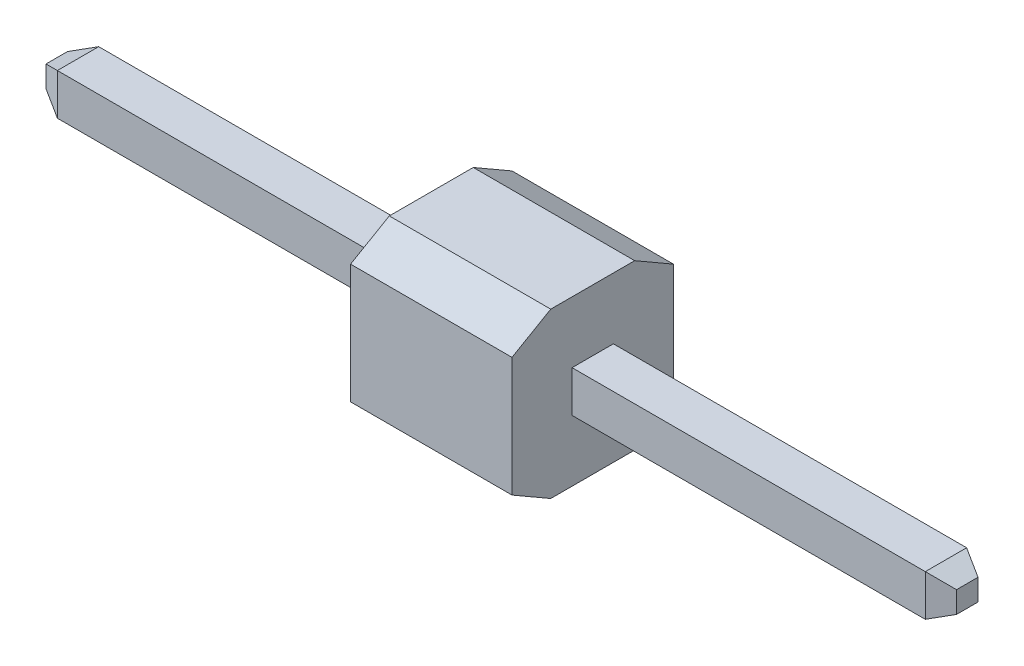
ISO-10303-21;
HEADER;
FILE_DESCRIPTION(('STEP AP214'),'2;1');
FILE_NAME('part.step','',(''),(''),'','','');
FILE_SCHEMA(('AUTOMOTIVE_DESIGN { 1 0 10303 214 1 1 1 1 }'));
ENDSEC;
DATA;
#1=APPLICATION_CONTEXT('core data for automotive mechanical design processes');
#2=APPLICATION_PROTOCOL_DEFINITION('international standard','automotive_design',2000,#1);
#3=PRODUCT_CONTEXT('',#1,'mechanical');
#4=PRODUCT('Part','Part','',(#3));
#5=PRODUCT_RELATED_PRODUCT_CATEGORY('part','',(#4));
#6=PRODUCT_DEFINITION_FORMATION('','',#4);
#7=PRODUCT_DEFINITION_CONTEXT('part definition',#1,'design');
#8=PRODUCT_DEFINITION('design','',#6,#7);
#9=PRODUCT_DEFINITION_SHAPE('','',#8);
#10=(LENGTH_UNIT() NAMED_UNIT(*) SI_UNIT(.MILLI.,.METRE.));
#11=(NAMED_UNIT(*) PLANE_ANGLE_UNIT() SI_UNIT($,.RADIAN.));
#12=(NAMED_UNIT(*) SI_UNIT($,.STERADIAN.) SOLID_ANGLE_UNIT());
#13=UNCERTAINTY_MEASURE_WITH_UNIT(LENGTH_MEASURE(1.E-05),#10,'distance_accuracy_value','');
#14=(GEOMETRIC_REPRESENTATION_CONTEXT(3) GLOBAL_UNCERTAINTY_ASSIGNED_CONTEXT((#13)) GLOBAL_UNIT_ASSIGNED_CONTEXT((#10,
#11,#12)) REPRESENTATION_CONTEXT('',''));
#15=CARTESIAN_POINT('',(0.,0.,0.));
#16=DIRECTION('',(0.,0.,1.));
#17=DIRECTION('',(1.,0.,0.));
#18=AXIS2_PLACEMENT_3D('',#15,#16,#17);
#19=CARTESIAN_POINT('',(5.42107494554601,-0.317121587193697,0.629998634255617));
#20=DIRECTION('',(1.,4.37113882867379E-08,-4.37113882867379E-08));
#21=DIRECTION('',(-4.37113882867379E-08,1.,0.));
#22=AXIS2_PLACEMENT_3D('',#19,#20,#21);
#23=PLANE('',#22);
#24=DIRECTION('',(1.59994777304463E-08,0.500000000000192,0.866025403784328));
#25=VECTOR('',#24,1.);
#26=CARTESIAN_POINT('',(5.42107482256009,0.926468251296299,-0.940001365744382));
#27=LINE('',#26,#25);
#28=CARTESIAN_POINT('',(5.42107482256009,0.926468251296299,-0.940001365744382));
#29=VERTEX_POINT('',#28);
#30=CARTESIAN_POINT('',(5.42107483364485,1.2728784128063,-0.340001365744383));
#31=VERTEX_POINT('',#30);
#32=EDGE_CURVE('E11',#29,#31,#27,.T.);
#33=ORIENTED_EDGE('',*,*,#32,.T.);
#34=DIRECTION('',(4.37113886966664E-08,0.,0.999999999999999));
#35=VECTOR('',#34,1.);
#36=CARTESIAN_POINT('',(5.42107483364485,1.2728784128063,-0.340001365744383));
#37=LINE('',#36,#35);
#38=CARTESIAN_POINT('',(5.42107489046966,1.2728784128063,0.959998634255618));
#39=VERTEX_POINT('',#38);
#40=EDGE_CURVE('E304',#31,#39,#37,.T.);
#41=ORIENTED_EDGE('',*,*,#40,.T.);
#42=DIRECTION('',(5.9710866882576E-08,-0.500000000000187,0.866025403784329));
#43=VECTOR('',#42,1.);
#44=CARTESIAN_POINT('',(5.42107489046966,1.2728784128063,0.959998634255618));
#45=LINE('',#44,#43);
#46=CARTESIAN_POINT('',(5.42107493183856,0.926468251296305,1.55999863425562));
#47=VERTEX_POINT('',#46);
#48=EDGE_CURVE('E296',#39,#47,#45,.T.);
#49=ORIENTED_EDGE('',*,*,#48,.T.);
#50=DIRECTION('',(4.37113884815545E-08,-0.999999999999999,0.));
#51=VECTOR('',#50,1.);
#52=CARTESIAN_POINT('',(5.42107493183856,0.926468251296305,1.55999863425562));
#53=LINE('',#52,#51);
#54=CARTESIAN_POINT('',(5.42107501258135,-0.920711425673696,1.55999863425562));
#55=VERTEX_POINT('',#54);
#56=EDGE_CURVE('E281',#47,#55,#53,.T.);
#57=ORIENTED_EDGE('',*,*,#56,.T.);
#58=DIRECTION('',(1.5999479012306E-08,0.500000000000192,0.866025403784328));
#59=VECTOR('',#58,1.);
#60=CARTESIAN_POINT('',(5.42107500149658,-1.2671215871937,0.959998634255618));
#61=LINE('',#60,#59);
#62=CARTESIAN_POINT('',(5.42107500149658,-1.2671215871937,0.959998634255618));
#63=VERTEX_POINT('',#62);
#64=EDGE_CURVE('E265',#63,#55,#61,.T.);
#65=ORIENTED_EDGE('',*,*,#64,.F.);
#66=DIRECTION('',(4.37113886966664E-08,0.,0.999999999999999));
#67=VECTOR('',#66,1.);
#68=CARTESIAN_POINT('',(5.42107494467178,-1.2671215871937,-0.340001365744383));
#69=LINE('',#68,#67);
#70=CARTESIAN_POINT('',(5.42107494467178,-1.2671215871937,-0.340001365744383));
#71=VERTEX_POINT('',#70);
#72=EDGE_CURVE('E248',#71,#63,#69,.T.);
#73=ORIENTED_EDGE('',*,*,#72,.F.);
#74=DIRECTION('',(5.97108656001699E-08,-0.500000000000189,0.866025403784328));
#75=VECTOR('',#74,1.);
#76=CARTESIAN_POINT('',(5.42107490330288,-0.920711425673701,-0.940001365744382));
#77=LINE('',#76,#75);
#78=CARTESIAN_POINT('',(5.42107490330288,-0.920711425673701,-0.940001365744382));
#79=VERTEX_POINT('',#78);
#80=EDGE_CURVE('E242',#79,#71,#77,.T.);
#81=ORIENTED_EDGE('',*,*,#80,.F.);
#82=DIRECTION('',(4.37113884815545E-08,-0.999999999999999,0.));
#83=VECTOR('',#82,1.);
#84=CARTESIAN_POINT('',(5.42107482256009,0.926468251296299,-0.940001365744382));
#85=LINE('',#84,#83);
#86=EDGE_CURVE('E236',#29,#79,#85,.T.);
#87=ORIENTED_EDGE('',*,*,#86,.F.);
#88=EDGE_LOOP('',(#33,#41,#49,#57,#65,#73,#81,#87));
#89=FACE_BOUND('',#88,.T.);
#90=DIRECTION('',(-4.37113886753159E-08,0.,-0.999999999999999));
#91=VECTOR('',#90,1.);
#92=CARTESIAN_POINT('',(5.42107491757072,0.322878412806302,0.629998634255617));
#93=LINE('',#92,#91);
#94=CARTESIAN_POINT('',(5.42107491757072,0.322878412806302,0.629998634255617));
#95=VERTEX_POINT('',#94);
#96=CARTESIAN_POINT('',(5.42107488959543,0.322878412806301,-0.0100013657443826));
#97=VERTEX_POINT('',#96);
#98=EDGE_CURVE('E302',#95,#97,#93,.T.);
#99=ORIENTED_EDGE('',*,*,#98,.T.);
#100=DIRECTION('',(-4.3711388675316E-08,0.999999999999999,0.));
#101=VECTOR('',#100,1.);
#102=CARTESIAN_POINT('',(5.42107491757072,-0.317121587193698,-0.0100013657443826));
#103=LINE('',#102,#101);
#104=CARTESIAN_POINT('',(5.42107491757072,-0.317121587193698,-0.0100013657443826));
#105=VERTEX_POINT('',#104);
#106=EDGE_CURVE('E293',#105,#97,#103,.T.);
#107=ORIENTED_EDGE('',*,*,#106,.F.);
#108=DIRECTION('',(-4.37113886753159E-08,0.,-0.999999999999999));
#109=VECTOR('',#108,1.);
#110=CARTESIAN_POINT('',(5.42107494554601,-0.317121587193697,0.629998634255617));
#111=LINE('',#110,#109);
#112=CARTESIAN_POINT('',(5.42107494554601,-0.317121587193697,0.629998634255617));
#113=VERTEX_POINT('',#112);
#114=EDGE_CURVE('E278',#113,#105,#111,.T.);
#115=ORIENTED_EDGE('',*,*,#114,.F.);
#116=DIRECTION('',(-4.3711388675316E-08,0.999999999999999,0.));
#117=VECTOR('',#116,1.);
#118=CARTESIAN_POINT('',(5.42107494554601,-0.317121587193697,0.629998634255617));
#119=LINE('',#118,#117);
#120=EDGE_CURVE('E263',#113,#95,#119,.T.);
#121=ORIENTED_EDGE('',*,*,#120,.T.);
#122=EDGE_LOOP('',(#99,#107,#115,#121));
#123=FACE_BOUND('',#122,.T.);
#124=ADVANCED_FACE('F17',(#89,#123),#23,.T.);
#125=CARTESIAN_POINT('',(2.92107494554601,-0.317121696472167,0.629998743534088));
#126=DIRECTION('',(1.,4.37113882867379E-08,-4.37113882867379E-08));
#127=DIRECTION('',(-4.37113882867379E-08,1.,0.));
#128=AXIS2_PLACEMENT_3D('',#125,#126,#127);
#129=PLANE('',#128);
#130=DIRECTION('',(1.59994783714339E-08,0.500000000000192,0.866025403784328));
#131=VECTOR('',#130,1.);
#132=CARTESIAN_POINT('',(2.92107482256009,0.926468142017828,-0.940001256465912));
#133=LINE('',#132,#131);
#134=CARTESIAN_POINT('',(2.92107482256009,0.926468142017828,-0.940001256465912));
#135=VERTEX_POINT('',#134);
#136=CARTESIAN_POINT('',(2.92107483364485,1.27287830352783,-0.340001256465912));
#137=VERTEX_POINT('',#136);
#138=EDGE_CURVE('E24',#135,#137,#133,.T.);
#139=ORIENTED_EDGE('',*,*,#138,.F.);
#140=DIRECTION('',(4.37113882411397E-08,-0.999999999999999,0.));
#141=VECTOR('',#140,1.);
#142=CARTESIAN_POINT('',(2.92107482256009,0.926468142017828,-0.940001256465912));
#143=LINE('',#142,#141);
#144=CARTESIAN_POINT('',(2.92107490330288,-0.920711534952172,-0.940001256465912));
#145=VERTEX_POINT('',#144);
#146=EDGE_CURVE('E300',#135,#145,#143,.T.);
#147=ORIENTED_EDGE('',*,*,#146,.T.);
#148=DIRECTION('',(5.97108668821451E-08,-0.500000000000189,0.866025403784328));
#149=VECTOR('',#148,1.);
#150=CARTESIAN_POINT('',(2.92107490330288,-0.920711534952172,-0.940001256465912));
#151=LINE('',#150,#149);
#152=CARTESIAN_POINT('',(2.92107494467178,-1.26712169647217,-0.340001256465912));
#153=VERTEX_POINT('',#152);
#154=EDGE_CURVE('E286',#145,#153,#151,.T.);
#155=ORIENTED_EDGE('',*,*,#154,.T.);
#156=DIRECTION('',(4.37113883550593E-08,0.,0.999999999999999));
#157=VECTOR('',#156,1.);
#158=CARTESIAN_POINT('',(2.92107494467178,-1.26712169647217,-0.340001256465912));
#159=LINE('',#158,#157);
#160=CARTESIAN_POINT('',(2.92107500149659,-1.26712169647217,0.959998743534088));
#161=VERTEX_POINT('',#160);
#162=EDGE_CURVE('E271',#153,#161,#159,.T.);
#163=ORIENTED_EDGE('',*,*,#162,.T.);
#164=DIRECTION('',(1.59994783713184E-08,0.500000000000192,0.866025403784328));
#165=VECTOR('',#164,1.);
#166=CARTESIAN_POINT('',(2.92107500149659,-1.26712169647217,0.959998743534088));
#167=LINE('',#166,#165);
#168=CARTESIAN_POINT('',(2.92107501258135,-0.920711534952167,1.55999874353409));
#169=VERTEX_POINT('',#168);
#170=EDGE_CURVE('E253',#161,#169,#167,.T.);
#171=ORIENTED_EDGE('',*,*,#170,.T.);
#172=DIRECTION('',(4.37113882411397E-08,-0.999999999999999,0.));
#173=VECTOR('',#172,1.);
#174=CARTESIAN_POINT('',(2.92107493183856,0.926468142017834,1.55999874353409));
#175=LINE('',#174,#173);
#176=CARTESIAN_POINT('',(2.92107493183856,0.926468142017834,1.55999874353409));
#177=VERTEX_POINT('',#176);
#178=EDGE_CURVE('E261',#177,#169,#175,.T.);
#179=ORIENTED_EDGE('',*,*,#178,.F.);
#180=DIRECTION('',(5.9710866882576E-08,-0.500000000000187,0.866025403784329));
#181=VECTOR('',#180,1.);
#182=CARTESIAN_POINT('',(2.92107489046966,1.27287830352783,0.959998743534088));
#183=LINE('',#182,#181);
#184=CARTESIAN_POINT('',(2.92107489046966,1.27287830352783,0.959998743534088));
#185=VERTEX_POINT('',#184);
#186=EDGE_CURVE('E276',#185,#177,#183,.T.);
#187=ORIENTED_EDGE('',*,*,#186,.F.);
#188=DIRECTION('',(4.37113883550593E-08,0.,0.999999999999999));
#189=VECTOR('',#188,1.);
#190=CARTESIAN_POINT('',(2.92107483364485,1.27287830352783,-0.340001256465912));
#191=LINE('',#190,#189);
#192=EDGE_CURVE('E291',#137,#185,#191,.T.);
#193=ORIENTED_EDGE('',*,*,#192,.F.);
#194=EDGE_LOOP('',(#139,#147,#155,#163,#171,#179,#187,#193));
#195=FACE_BOUND('',#194,.T.);
#196=DIRECTION('',(-4.3711388675316E-08,0.999999999999999,0.));
#197=VECTOR('',#196,1.);
#198=CARTESIAN_POINT('',(2.92107491757072,-0.317121696472169,-0.0100012564659119));
#199=LINE('',#198,#197);
#200=CARTESIAN_POINT('',(2.92107491757072,-0.317121696472169,-0.0100012564659119));
#201=VERTEX_POINT('',#200);
#202=CARTESIAN_POINT('',(2.92107488959543,0.32287830352783,-0.0100012564659119));
#203=VERTEX_POINT('',#202);
#204=EDGE_CURVE('E298',#201,#203,#199,.T.);
#205=ORIENTED_EDGE('',*,*,#204,.T.);
#206=DIRECTION('',(-4.37113886753159E-08,0.,-0.999999999999999));
#207=VECTOR('',#206,1.);
#208=CARTESIAN_POINT('',(2.92107491757072,0.322878303527832,0.629998743534088));
#209=LINE('',#208,#207);
#210=CARTESIAN_POINT('',(2.92107491757072,0.322878303527832,0.629998743534088));
#211=VERTEX_POINT('',#210);
#212=EDGE_CURVE('E283',#211,#203,#209,.T.);
#213=ORIENTED_EDGE('',*,*,#212,.F.);
#214=DIRECTION('',(-4.37113879814266E-08,0.999999999999999,0.));
#215=VECTOR('',#214,1.);
#216=CARTESIAN_POINT('',(2.92107494554601,-0.317121696472167,0.629998743534088));
#217=LINE('',#216,#215);
#218=CARTESIAN_POINT('',(2.92107494554601,-0.317121696472167,0.629998743534088));
#219=VERTEX_POINT('',#218);
#220=EDGE_CURVE('E268',#219,#211,#217,.T.);
#221=ORIENTED_EDGE('',*,*,#220,.F.);
#222=DIRECTION('',(-4.37113879814266E-08,0.,-0.999999999999999));
#223=VECTOR('',#222,1.);
#224=CARTESIAN_POINT('',(2.92107494554601,-0.317121696472167,0.629998743534088));
#225=LINE('',#224,#223);
#226=EDGE_CURVE('E251',#219,#201,#225,.T.);
#227=ORIENTED_EDGE('',*,*,#226,.T.);
#228=EDGE_LOOP('',(#205,#213,#221,#227));
#229=FACE_BOUND('',#228,.T.);
#230=ADVANCED_FACE('F314',(#195,#229),#129,.F.);
#231=CARTESIAN_POINT('',(5.42107482256009,0.926468251296299,-0.940001365744382));
#232=DIRECTION('',(5.97108668343731E-08,-0.866025403784328,0.50000000000019));
#233=DIRECTION('',(-1.59994785476185E-08,-0.500000000000192,-0.866025403784329));
#234=AXIS2_PLACEMENT_3D('',#231,#232,#233);
#235=PLANE('',#234);
#236=ORIENTED_EDGE('',*,*,#138,.T.);
#237=DIRECTION('',(-0.999999999999998,-4.37113882867378E-08,4.37113883755557E-08));
#238=VECTOR('',#237,1.);
#239=CARTESIAN_POINT('',(5.42107483364485,1.2728784128063,-0.340001365744383));
#240=LINE('',#239,#238);
#241=EDGE_CURVE('E288',#31,#137,#240,.T.);
#242=ORIENTED_EDGE('',*,*,#241,.F.);
#243=ORIENTED_EDGE('',*,*,#32,.F.);
#244=DIRECTION('',(-0.999999999999998,-4.37113882867378E-08,4.37113881091022E-08));
#245=VECTOR('',#244,1.);
#246=CARTESIAN_POINT('',(5.42107482256009,0.926468251296299,-0.940001365744382));
#247=LINE('',#246,#245);
#248=EDGE_CURVE('E256',#29,#135,#247,.T.);
#249=ORIENTED_EDGE('',*,*,#248,.T.);
#250=EDGE_LOOP('',(#236,#242,#243,#249));
#251=FACE_BOUND('',#250,.T.);
#252=ADVANCED_FACE('F306',(#251),#235,.F.);
#253=CARTESIAN_POINT('',(5.42107483364485,1.2728784128063,-0.340001365744383));
#254=DIRECTION('',(4.37113882867379E-08,-1.,0.));
#255=DIRECTION('',(1.,4.37113882867379E-08,-4.37113882867379E-08));
#256=AXIS2_PLACEMENT_3D('',#253,#254,#255);
#257=PLANE('',#256);
#258=ORIENTED_EDGE('',*,*,#192,.T.);
#259=DIRECTION('',(-0.999999999999998,-4.37113882867378E-08,4.37113882867378E-08));
#260=VECTOR('',#259,1.);
#261=CARTESIAN_POINT('',(5.42107489046966,1.2728784128063,0.959998634255618));
#262=LINE('',#261,#260);
#263=EDGE_CURVE('E273',#39,#185,#262,.T.);
#264=ORIENTED_EDGE('',*,*,#263,.F.);
#265=ORIENTED_EDGE('',*,*,#40,.F.);
#266=ORIENTED_EDGE('',*,*,#241,.T.);
#267=EDGE_LOOP('',(#258,#264,#265,#266));
#268=FACE_BOUND('',#267,.T.);
#269=ADVANCED_FACE('F311',(#268),#257,.F.);
#270=CARTESIAN_POINT('',(5.42107489046966,1.2728784128063,0.959998634255618));
#271=DIRECTION('',(1.59994785476185E-08,-0.86602540378433,-0.50000000000019));
#272=DIRECTION('',(-5.97108668343731E-08,0.500000000000188,-0.866025403784329));
#273=AXIS2_PLACEMENT_3D('',#270,#271,#272);
#274=PLANE('',#273);
#275=ORIENTED_EDGE('',*,*,#186,.T.);
#276=DIRECTION('',(-0.999999999999998,-4.37113882867378E-08,4.37113882867378E-08));
#277=VECTOR('',#276,1.);
#278=CARTESIAN_POINT('',(5.42107493183856,0.926468251296305,1.55999863425562));
#279=LINE('',#278,#277);
#280=EDGE_CURVE('E258',#47,#177,#279,.T.);
#281=ORIENTED_EDGE('',*,*,#280,.F.);
#282=ORIENTED_EDGE('',*,*,#48,.F.);
#283=ORIENTED_EDGE('',*,*,#263,.T.);
#284=EDGE_LOOP('',(#275,#281,#282,#283));
#285=FACE_BOUND('',#284,.T.);
#286=ADVANCED_FACE('F319',(#285),#274,.F.);
#287=CARTESIAN_POINT('',(5.42107493183856,0.926468251296305,1.55999863425562));
#288=DIRECTION('',(-4.37113882867379E-08,0.,-1.));
#289=DIRECTION('',(-1.,-4.37113882867379E-08,4.37113882867379E-08));
#290=AXIS2_PLACEMENT_3D('',#287,#288,#289);
#291=PLANE('',#290);
#292=ORIENTED_EDGE('',*,*,#178,.T.);
#293=DIRECTION('',(-0.999999999999998,-4.37113897078233E-08,4.37113882867378E-08));
#294=VECTOR('',#293,1.);
#295=CARTESIAN_POINT('',(5.42107501258135,-0.920711425673696,1.55999863425562));
#296=LINE('',#295,#294);
#297=EDGE_CURVE('E245',#55,#169,#296,.T.);
#298=ORIENTED_EDGE('',*,*,#297,.F.);
#299=ORIENTED_EDGE('',*,*,#56,.F.);
#300=ORIENTED_EDGE('',*,*,#280,.T.);
#301=EDGE_LOOP('',(#292,#298,#299,#300));
#302=FACE_BOUND('',#301,.T.);
#303=ADVANCED_FACE('F326',(#302),#291,.F.);
#304=CARTESIAN_POINT('',(5.42107500149658,-1.2671215871937,0.959998634255618));
#305=DIRECTION('',(5.97108668343731E-08,-0.866025403784328,0.50000000000019));
#306=DIRECTION('',(-1.59994785476185E-08,-0.500000000000192,-0.866025403784329));
#307=AXIS2_PLACEMENT_3D('',#304,#305,#306);
#308=PLANE('',#307);
#309=ORIENTED_EDGE('',*,*,#170,.F.);
#310=DIRECTION('',(-0.999999999999998,-4.37113875761951E-08,4.37113882867378E-08));
#311=VECTOR('',#310,1.);
#312=CARTESIAN_POINT('',(5.42107500149658,-1.2671215871937,0.959998634255618));
#313=LINE('',#312,#311);
#314=EDGE_CURVE('E239',#63,#161,#313,.T.);
#315=ORIENTED_EDGE('',*,*,#314,.F.);
#316=ORIENTED_EDGE('',*,*,#64,.T.);
#317=ORIENTED_EDGE('',*,*,#297,.T.);
#318=EDGE_LOOP('',(#309,#315,#316,#317));
#319=FACE_BOUND('',#318,.T.);
#320=ADVANCED_FACE('F329',(#319),#308,.T.);
#321=CARTESIAN_POINT('',(5.42107494467178,-1.2671215871937,-0.340001365744383));
#322=DIRECTION('',(4.37113882867379E-08,-1.,0.));
#323=DIRECTION('',(1.,4.37113882867379E-08,-4.37113882867379E-08));
#324=AXIS2_PLACEMENT_3D('',#321,#322,#323);
#325=PLANE('',#324);
#326=ORIENTED_EDGE('',*,*,#162,.F.);
#327=DIRECTION('',(-0.999999999999998,-4.37113875761951E-08,4.37113883755557E-08));
#328=VECTOR('',#327,1.);
#329=CARTESIAN_POINT('',(5.42107494467178,-1.2671215871937,-0.340001365744383));
#330=LINE('',#329,#328);
#331=EDGE_CURVE('E233',#71,#153,#330,.T.);
#332=ORIENTED_EDGE('',*,*,#331,.F.);
#333=ORIENTED_EDGE('',*,*,#72,.T.);
#334=ORIENTED_EDGE('',*,*,#314,.T.);
#335=EDGE_LOOP('',(#326,#332,#333,#334));
#336=FACE_BOUND('',#335,.T.);
#337=ADVANCED_FACE('F333',(#336),#325,.T.);
#338=CARTESIAN_POINT('',(5.42107490330288,-0.920711425673701,-0.940001365744382));
#339=DIRECTION('',(1.59994785476185E-08,-0.86602540378433,-0.50000000000019));
#340=DIRECTION('',(-5.97108668343731E-08,0.500000000000188,-0.866025403784329));
#341=AXIS2_PLACEMENT_3D('',#338,#339,#340);
#342=PLANE('',#341);
#343=ORIENTED_EDGE('',*,*,#154,.F.);
#344=DIRECTION('',(-0.999999999999998,-4.37113897078233E-08,4.37113881091021E-08));
#345=VECTOR('',#344,1.);
#346=CARTESIAN_POINT('',(5.42107490330288,-0.920711425673701,-0.940001365744382));
#347=LINE('',#346,#345);
#348=EDGE_CURVE('E230',#79,#145,#347,.T.);
#349=ORIENTED_EDGE('',*,*,#348,.F.);
#350=ORIENTED_EDGE('',*,*,#80,.T.);
#351=ORIENTED_EDGE('',*,*,#331,.T.);
#352=EDGE_LOOP('',(#343,#349,#350,#351));
#353=FACE_BOUND('',#352,.T.);
#354=ADVANCED_FACE('F337',(#353),#342,.T.);
#355=CARTESIAN_POINT('',(5.42107482256009,0.926468251296299,-0.940001365744382));
#356=DIRECTION('',(-4.37113882867379E-08,0.,-1.));
#357=DIRECTION('',(-4.37113882867379E-08,1.,0.));
#358=AXIS2_PLACEMENT_3D('',#355,#356,#357);
#359=PLANE('',#358);
#360=ORIENTED_EDGE('',*,*,#146,.F.);
#361=ORIENTED_EDGE('',*,*,#248,.F.);
#362=ORIENTED_EDGE('',*,*,#86,.T.);
#363=ORIENTED_EDGE('',*,*,#348,.T.);
#364=EDGE_LOOP('',(#360,#361,#362,#363));
#365=FACE_BOUND('',#364,.T.);
#366=ADVANCED_FACE('F339',(#365),#359,.T.);
#367=CARTESIAN_POINT('',(-2.87892505445399,-0.317121949998219,0.62999899706014));
#368=DIRECTION('',(-1.,-4.37113882867379E-08,4.37113882867379E-08));
#369=DIRECTION('',(4.37113882867379E-08,-1.,0.));
#370=AXIS2_PLACEMENT_3D('',#367,#368,#369);
#371=PLANE('',#370);
#372=DIRECTION('',(4.37113900757526E-08,-0.999999999999999,0.));
#373=VECTOR('',#372,1.);
#374=CARTESIAN_POINT('',(-2.87892509695182,0.168996522811778,0.14388052425114));
#375=LINE('',#374,#373);
#376=CARTESIAN_POINT('',(-2.87892509695182,0.168996522811778,0.14388052425114));
#377=VERTEX_POINT('',#376);
#378=CARTESIAN_POINT('',(-2.87892508242928,-0.163240422798221,0.14388052425114));
#379=VERTEX_POINT('',#378);
#380=EDGE_CURVE('E228',#377,#379,#375,.T.);
#381=ORIENTED_EDGE('',*,*,#380,.T.);
#382=DIRECTION('',(4.37113874013716E-08,0.,0.999999999999999));
#383=VECTOR('',#382,1.);
#384=CARTESIAN_POINT('',(-2.87892508242928,-0.163240422798221,0.14388052425114));
#385=LINE('',#384,#383);
#386=CARTESIAN_POINT('',(-2.87892506790674,-0.16324042279822,0.47611746986914));
#387=VERTEX_POINT('',#386);
#388=EDGE_CURVE('E223',#379,#387,#385,.T.);
#389=ORIENTED_EDGE('',*,*,#388,.T.);
#390=DIRECTION('',(-4.37113847290958E-08,0.999999999999999,0.));
#391=VECTOR('',#390,1.);
#392=CARTESIAN_POINT('',(-2.87892506790674,-0.163240422798221,0.47611746986914));
#393=LINE('',#392,#391);
#394=CARTESIAN_POINT('',(-2.87892508242928,0.16899652281178,0.47611746986914));
#395=VERTEX_POINT('',#394);
#396=EDGE_CURVE('E215',#387,#395,#393,.T.);
#397=ORIENTED_EDGE('',*,*,#396,.T.);
#398=DIRECTION('',(-4.37113820547151E-08,0.,-0.999999999999999));
#399=VECTOR('',#398,1.);
#400=CARTESIAN_POINT('',(-2.87892508242928,0.16899652281178,0.47611746986914));
#401=LINE('',#400,#399);
#402=EDGE_CURVE('E207',#395,#377,#401,.T.);
#403=ORIENTED_EDGE('',*,*,#402,.T.);
#404=EDGE_LOOP('',(#381,#389,#397,#403));
#405=FACE_BOUND('',#404,.T.);
#406=ADVANCED_FACE('F341',(#405),#371,.T.);
#407=CARTESIAN_POINT('',(-2.87892505445399,-0.317121949998219,0.62999899706014));
#408=DIRECTION('',(4.37113882867379E-08,-1.,0.));
#409=DIRECTION('',(-4.37113882867379E-08,0.,-1.));
#410=AXIS2_PLACEMENT_3D('',#407,#408,#409);
#411=PLANE('',#410);
#412=DIRECTION('',(0.999999999999998,4.37113875463186E-08,-4.37113882769955E-08));
#413=VECTOR('',#412,1.);
#414=CARTESIAN_POINT('',(-2.54892505445399,-0.317121935573461,0.629998982635382));
#415=LINE('',#414,#413);
#416=CARTESIAN_POINT('',(-2.54892505445399,-0.317121935573461,0.629998982635382));
#417=VERTEX_POINT('',#416);
#418=EDGE_CURVE('E225',#417,#219,#415,.T.);
#419=ORIENTED_EDGE('',*,*,#418,.F.);
#420=DIRECTION('',(-4.37113886753159E-08,0.,-0.999999999999999));
#421=VECTOR('',#420,1.);
#422=CARTESIAN_POINT('',(-2.54892505445399,-0.317121935573461,0.629998982635382));
#423=LINE('',#422,#421);
#424=CARTESIAN_POINT('',(-2.54892508242928,-0.317121935573462,-0.010001017364618));
#425=VERTEX_POINT('',#424);
#426=EDGE_CURVE('E217',#417,#425,#423,.T.);
#427=ORIENTED_EDGE('',*,*,#426,.T.);
#428=DIRECTION('',(0.999999999999998,4.37113875463185E-08,-4.37113882161057E-08));
#429=VECTOR('',#428,1.);
#430=CARTESIAN_POINT('',(-2.54892508242928,-0.317121935573462,-0.010001017364618));
#431=LINE('',#430,#429);
#432=EDGE_CURVE('E220',#425,#201,#431,.T.);
#433=ORIENTED_EDGE('',*,*,#432,.T.);
#434=ORIENTED_EDGE('',*,*,#226,.F.);
#435=EDGE_LOOP('',(#419,#427,#433,#434));
#436=FACE_BOUND('',#435,.T.);
#437=ADVANCED_FACE('F348',(#436),#411,.T.);
#438=CARTESIAN_POINT('',(-2.87892508242928,-0.317121949998221,-0.0100010029398598));
#439=DIRECTION('',(-4.37113882867379E-08,0.,-1.));
#440=DIRECTION('',(-1.,-4.37113882867379E-08,4.37113882867379E-08));
#441=AXIS2_PLACEMENT_3D('',#438,#439,#440);
#442=PLANE('',#441);
#443=ORIENTED_EDGE('',*,*,#432,.F.);
#444=DIRECTION('',(-4.3711388675316E-08,0.999999999999999,0.));
#445=VECTOR('',#444,1.);
#446=CARTESIAN_POINT('',(-2.54892508242928,-0.317121935573462,-0.010001017364618));
#447=LINE('',#446,#445);
#448=CARTESIAN_POINT('',(-2.54892511040457,0.322878064426536,-0.010001017364618));
#449=VERTEX_POINT('',#448);
#450=EDGE_CURVE('E209',#425,#449,#447,.T.);
#451=ORIENTED_EDGE('',*,*,#450,.T.);
#452=DIRECTION('',(0.999999999999998,4.37113865720826E-08,-4.37113882161057E-08));
#453=VECTOR('',#452,1.);
#454=CARTESIAN_POINT('',(-2.54892511040457,0.322878064426536,-0.010001017364618));
#455=LINE('',#454,#453);
#456=EDGE_CURVE('E212',#449,#203,#455,.T.);
#457=ORIENTED_EDGE('',*,*,#456,.T.);
#458=ORIENTED_EDGE('',*,*,#204,.F.);
#459=EDGE_LOOP('',(#443,#451,#457,#458));
#460=FACE_BOUND('',#459,.T.);
#461=ADVANCED_FACE('F424',(#460),#442,.T.);
#462=CARTESIAN_POINT('',(-2.87892508242928,0.32287805000178,0.62999899706014));
#463=DIRECTION('',(4.37113882867379E-08,-1.,0.));
#464=DIRECTION('',(-4.37113882867379E-08,0.,-1.));
#465=AXIS2_PLACEMENT_3D('',#462,#463,#464);
#466=PLANE('',#465);
#467=ORIENTED_EDGE('',*,*,#456,.F.);
#468=DIRECTION('',(4.37113900630947E-08,0.,0.999999999999999));
#469=VECTOR('',#468,1.);
#470=CARTESIAN_POINT('',(-2.54892511040457,0.322878064426536,-0.010001017364618));
#471=LINE('',#470,#469);
#472=CARTESIAN_POINT('',(-2.54892508242928,0.322878064426538,0.629998982635382));
#473=VERTEX_POINT('',#472);
#474=EDGE_CURVE('E201',#449,#473,#471,.T.);
#475=ORIENTED_EDGE('',*,*,#474,.T.);
#476=DIRECTION('',(0.999999999999998,4.37113865720826E-08,-4.37113882769955E-08));
#477=VECTOR('',#476,1.);
#478=CARTESIAN_POINT('',(-2.54892508242928,0.322878064426538,0.629998982635382));
#479=LINE('',#478,#477);
#480=EDGE_CURVE('E204',#473,#211,#479,.T.);
#481=ORIENTED_EDGE('',*,*,#480,.T.);
#482=ORIENTED_EDGE('',*,*,#212,.T.);
#483=EDGE_LOOP('',(#467,#475,#481,#482));
#484=FACE_BOUND('',#483,.T.);
#485=ADVANCED_FACE('F421',(#484),#466,.F.);
#486=CARTESIAN_POINT('',(-2.87892505445399,-0.317121949998219,0.62999899706014));
#487=DIRECTION('',(-4.37113882867379E-08,0.,-1.));
#488=DIRECTION('',(-1.,-4.37113882867379E-08,4.37113882867379E-08));
#489=AXIS2_PLACEMENT_3D('',#486,#487,#488);
#490=PLANE('',#489);
#491=ORIENTED_EDGE('',*,*,#480,.F.);
#492=DIRECTION('',(4.37113900630949E-08,-0.999999999999999,0.));
#493=VECTOR('',#492,1.);
#494=CARTESIAN_POINT('',(-2.54892508242928,0.322878064426536,0.629998982635382));
#495=LINE('',#494,#493);
#496=EDGE_CURVE('E196',#473,#417,#495,.T.);
#497=ORIENTED_EDGE('',*,*,#496,.T.);
#498=ORIENTED_EDGE('',*,*,#418,.T.);
#499=ORIENTED_EDGE('',*,*,#220,.T.);
#500=EDGE_LOOP('',(#491,#497,#498,#499));
#501=FACE_BOUND('',#500,.T.);
#502=ADVANCED_FACE('F376',(#501),#490,.F.);
#503=CARTESIAN_POINT('',(-2.87892505445399,-0.317121949998219,0.62999899706014));
#504=DIRECTION('',(-4.37113882867379E-08,0.,-1.));
#505=DIRECTION('',(-1.,-4.37113882867379E-08,4.37113882867379E-08));
#506=AXIS2_PLACEMENT_3D('',#503,#504,#505);
#507=PLANE('',#506);
#508=DIRECTION('',(0.999999999999998,4.37113829998842E-08,-4.37113882769955E-08));
#509=VECTOR('',#508,1.);
#510=CARTESIAN_POINT('',(5.42107494554601,-0.317121587193686,0.629998634255617));
#511=LINE('',#510,#509);
#512=CARTESIAN_POINT('',(10.891074945546,-0.317121348092403,0.629998395154324));
#513=VERTEX_POINT('',#512);
#514=EDGE_CURVE('E199',#113,#513,#511,.T.);
#515=ORIENTED_EDGE('',*,*,#514,.T.);
#516=DIRECTION('',(-4.37113900630948E-08,0.999999999999999,0.));
#517=VECTOR('',#516,1.);
#518=CARTESIAN_POINT('',(10.891074945546,-0.317121348092403,0.629998395154324));
#519=LINE('',#518,#517);
#520=CARTESIAN_POINT('',(10.8910749175707,0.322878651907596,0.629998395154324));
#521=VERTEX_POINT('',#520);
#522=EDGE_CURVE('E191',#513,#521,#519,.T.);
#523=ORIENTED_EDGE('',*,*,#522,.T.);
#524=DIRECTION('',(0.999999999999998,4.37113881958092E-08,-4.37113882769955E-08));
#525=VECTOR('',#524,1.);
#526=CARTESIAN_POINT('',(5.42107491757072,0.322878412806301,0.629998634255617));
#527=LINE('',#526,#525);
#528=EDGE_CURVE('E194',#95,#521,#527,.T.);
#529=ORIENTED_EDGE('',*,*,#528,.F.);
#530=ORIENTED_EDGE('',*,*,#120,.F.);
#531=EDGE_LOOP('',(#515,#523,#529,#530));
#532=FACE_BOUND('',#531,.T.);
#533=ADVANCED_FACE('F367',(#532),#507,.F.);
#534=CARTESIAN_POINT('',(-2.87892508242928,0.32287805000178,0.62999899706014));
#535=DIRECTION('',(4.37113882867379E-08,-1.,0.));
#536=DIRECTION('',(-4.37113882867379E-08,0.,-1.));
#537=AXIS2_PLACEMENT_3D('',#534,#535,#536);
#538=PLANE('',#537);
#539=ORIENTED_EDGE('',*,*,#528,.T.);
#540=DIRECTION('',(-4.37113900630947E-08,0.,-0.999999999999999));
#541=VECTOR('',#540,1.);
#542=CARTESIAN_POINT('',(10.8910749175707,0.322878651907596,0.629998395154324));
#543=LINE('',#542,#541);
#544=CARTESIAN_POINT('',(10.8910748895954,0.322878651907594,-0.0100016048456765));
#545=VERTEX_POINT('',#544);
#546=EDGE_CURVE('E186',#521,#545,#543,.T.);
#547=ORIENTED_EDGE('',*,*,#546,.T.);
#548=DIRECTION('',(0.999999999999998,4.37113881958092E-08,-4.37113881146228E-08));
#549=VECTOR('',#548,1.);
#550=CARTESIAN_POINT('',(5.42107488959543,0.322878412806299,-0.0100013657443823));
#551=LINE('',#550,#549);
#552=EDGE_CURVE('E189',#97,#545,#551,.T.);
#553=ORIENTED_EDGE('',*,*,#552,.F.);
#554=ORIENTED_EDGE('',*,*,#98,.F.);
#555=EDGE_LOOP('',(#539,#547,#553,#554));
#556=FACE_BOUND('',#555,.T.);
#557=ADVANCED_FACE('F364',(#556),#538,.F.);
#558=CARTESIAN_POINT('',(-2.87892508242928,-0.317121949998221,-0.0100010029398598));
#559=DIRECTION('',(-4.37113882867379E-08,0.,-1.));
#560=DIRECTION('',(-1.,-4.37113882867379E-08,4.37113882867379E-08));
#561=AXIS2_PLACEMENT_3D('',#558,#559,#560);
#562=PLANE('',#561);
#563=ORIENTED_EDGE('',*,*,#552,.T.);
#564=DIRECTION('',(4.37113900630949E-08,-0.999999999999999,0.));
#565=VECTOR('',#564,1.);
#566=CARTESIAN_POINT('',(10.8910748895954,0.322878651907592,-0.0100016048456764));
#567=LINE('',#566,#565);
#568=CARTESIAN_POINT('',(10.8910749175707,-0.317121348092405,-0.0100016048456765));
#569=VERTEX_POINT('',#568);
#570=EDGE_CURVE('E176',#545,#569,#567,.T.);
#571=ORIENTED_EDGE('',*,*,#570,.T.);
#572=DIRECTION('',(0.999999999999998,4.37113829998842E-08,-4.37113881146228E-08));
#573=VECTOR('',#572,1.);
#574=CARTESIAN_POINT('',(5.42107491757072,-0.317121587193688,-0.0100013657443823));
#575=LINE('',#574,#573);
#576=EDGE_CURVE('E179',#105,#569,#575,.T.);
#577=ORIENTED_EDGE('',*,*,#576,.F.);
#578=ORIENTED_EDGE('',*,*,#106,.T.);
#579=EDGE_LOOP('',(#563,#571,#577,#578));
#580=FACE_BOUND('',#579,.T.);
#581=ADVANCED_FACE('F366',(#580),#562,.T.);
#582=CARTESIAN_POINT('',(-2.87892505445399,-0.317121949998219,0.62999899706014));
#583=DIRECTION('',(4.37113882867379E-08,-1.,0.));
#584=DIRECTION('',(-4.37113882867379E-08,0.,-1.));
#585=AXIS2_PLACEMENT_3D('',#582,#583,#584);
#586=PLANE('',#585);
#587=ORIENTED_EDGE('',*,*,#576,.T.);
#588=DIRECTION('',(4.37113900630947E-08,0.,0.999999999999999));
#589=VECTOR('',#588,1.);
#590=CARTESIAN_POINT('',(10.8910749175707,-0.317121348092405,-0.0100016048456765));
#591=LINE('',#590,#589);
#592=EDGE_CURVE('E167',#569,#513,#591,.T.);
#593=ORIENTED_EDGE('',*,*,#592,.T.);
#594=ORIENTED_EDGE('',*,*,#514,.F.);
#595=ORIENTED_EDGE('',*,*,#114,.T.);
#596=EDGE_LOOP('',(#587,#593,#594,#595));
#597=FACE_BOUND('',#596,.T.);
#598=ADVANCED_FACE('F373',(#597),#586,.T.);
#599=CARTESIAN_POINT('',(11.221074945546,-0.317121333667645,0.629998380729565));
#600=DIRECTION('',(-1.,-4.37113882867379E-08,4.37113882867379E-08));
#601=DIRECTION('',(4.37113882867379E-08,-1.,0.));
#602=AXIS2_PLACEMENT_3D('',#599,#600,#601);
#603=PLANE('',#602);
#604=DIRECTION('',(-4.3711387402424E-08,0.999999999999999,0.));
#605=VECTOR('',#604,1.);
#606=CARTESIAN_POINT('',(11.2210749175707,-0.163239806467649,0.143879907920565));
#607=LINE('',#606,#605);
#608=CARTESIAN_POINT('',(11.2210749175707,-0.163239806467647,0.143879907920565));
#609=VERTEX_POINT('',#608);
#610=CARTESIAN_POINT('',(11.2210749030482,0.168997139142352,0.143879907920565));
#611=VERTEX_POINT('',#610);
#612=EDGE_CURVE('E153',#609,#611,#607,.T.);
#613=ORIENTED_EDGE('',*,*,#612,.T.);
#614=DIRECTION('',(4.37113874013716E-08,0.,0.999999999999999));
#615=VECTOR('',#614,1.);
#616=CARTESIAN_POINT('',(11.2210749030482,0.168997139142352,0.143879907920565));
#617=LINE('',#616,#615);
#618=CARTESIAN_POINT('',(11.2210749175707,0.168997139142354,0.476116853538565));
#619=VERTEX_POINT('',#618);
#620=EDGE_CURVE('E395',#611,#619,#617,.T.);
#621=ORIENTED_EDGE('',*,*,#620,.T.);
#622=DIRECTION('',(4.37113927490808E-08,-0.999999999999999,0.));
#623=VECTOR('',#622,1.);
#624=CARTESIAN_POINT('',(11.2210749175707,0.168997139142354,0.476116853538565));
#625=LINE('',#624,#623);
#626=CARTESIAN_POINT('',(11.2210749320933,-0.163239806467645,0.476116853538565));
#627=VERTEX_POINT('',#626);
#628=EDGE_CURVE('E156',#619,#627,#625,.T.);
#629=ORIENTED_EDGE('',*,*,#628,.T.);
#630=DIRECTION('',(-4.37113980946847E-08,0.,-0.999999999999999));
#631=VECTOR('',#630,1.);
#632=CARTESIAN_POINT('',(11.2210749320933,-0.163239806467645,0.476116853538565));
#633=LINE('',#632,#631);
#634=EDGE_CURVE('E149',#627,#609,#633,.T.);
#635=ORIENTED_EDGE('',*,*,#634,.T.);
#636=EDGE_LOOP('',(#613,#621,#629,#635));
#637=FACE_BOUND('',#636,.T.);
#638=ADVANCED_FACE('F151',(#637),#603,.F.);
#639=CARTESIAN_POINT('',(-2.8789250757029,0.16899652281178,0.62999899706014));
#640=DIRECTION('',(-0.422618301356784,0.906307768563367,1.84732310895534E-08));
#641=DIRECTION('',(4.37113882867379E-08,0.,1.));
#642=AXIS2_PLACEMENT_3D('',#639,#640,#641);
#643=PLANE('',#642);
#644=DIRECTION('',(0.834817095446926,0.389281657126017,-0.389281657126019));
#645=VECTOR('',#644,1.);
#646=CARTESIAN_POINT('',(-2.87892509695183,0.168996522812296,0.143880524251623));
#647=LINE('',#646,#645);
#648=EDGE_CURVE('E181',#377,#449,#647,.T.);
#649=ORIENTED_EDGE('',*,*,#648,.F.);
#650=ORIENTED_EDGE('',*,*,#402,.F.);
#651=DIRECTION('',(-0.834817129479006,-0.389281657126019,-0.389281584143989));
#652=VECTOR('',#651,1.);
#653=CARTESIAN_POINT('',(-2.54892508242971,0.322878064428,0.629998982634844));
#654=LINE('',#653,#652);
#655=EDGE_CURVE('E404',#473,#395,#654,.T.);
#656=ORIENTED_EDGE('',*,*,#655,.F.);
#657=ORIENTED_EDGE('',*,*,#474,.F.);
#658=EDGE_LOOP('',(#649,#650,#656,#657));
#659=FACE_BOUND('',#658,.T.);
#660=ADVANCED_FACE('F418',(#659),#643,.T.);
#661=CARTESIAN_POINT('',(-2.87892506118037,-0.317121949998219,0.47611746986914));
#662=DIRECTION('',(-0.422618222124841,-1.84732292043498E-08,0.906307805509828));
#663=DIRECTION('',(4.37113882867379E-08,-1.,0.));
#664=AXIS2_PLACEMENT_3D('',#661,#662,#663);
#665=PLANE('',#664);
#666=ORIENTED_EDGE('',*,*,#655,.T.);
#667=ORIENTED_EDGE('',*,*,#396,.F.);
#668=DIRECTION('',(-0.834817163511086,0.389281584143988,-0.389281584143986));
#669=VECTOR('',#668,1.);
#670=CARTESIAN_POINT('',(-2.54892505445285,-0.317121935570734,0.629998982635653));
#671=LINE('',#670,#669);
#672=EDGE_CURVE('E160',#417,#387,#671,.T.);
#673=ORIENTED_EDGE('',*,*,#672,.F.);
#674=ORIENTED_EDGE('',*,*,#496,.F.);
#675=EDGE_LOOP('',(#666,#667,#673,#674));
#676=FACE_BOUND('',#675,.T.);
#677=ADVANCED_FACE('F434',(#676),#665,.T.);
#678=CARTESIAN_POINT('',(-2.54892508242928,-0.317121935573462,-0.010001017364618));
#679=DIRECTION('',(0.422618301356784,1.8473232667688E-08,0.906307768563367));
#680=DIRECTION('',(-4.37113882867379E-08,1.,0.));
#681=AXIS2_PLACEMENT_3D('',#678,#679,#680);
#682=PLANE('',#681);
#683=ORIENTED_EDGE('',*,*,#648,.T.);
#684=ORIENTED_EDGE('',*,*,#450,.F.);
#685=DIRECTION('',(0.834817129479007,-0.389281584143989,-0.389281657126018));
#686=VECTOR('',#685,1.);
#687=CARTESIAN_POINT('',(-2.87892508243212,-0.16324042280576,0.1438805242526));
#688=LINE('',#687,#686);
#689=EDGE_CURVE('E170',#379,#425,#688,.T.);
#690=ORIENTED_EDGE('',*,*,#689,.F.);
#691=ORIENTED_EDGE('',*,*,#380,.F.);
#692=EDGE_LOOP('',(#683,#684,#690,#691));
#693=FACE_BOUND('',#692,.T.);
#694=ADVANCED_FACE('F413',(#693),#682,.F.);
#695=CARTESIAN_POINT('',(-2.54892505445399,-0.317121935573461,0.629998982635382));
#696=DIRECTION('',(0.422618222124841,0.906307805509828,-1.84732308250282E-08));
#697=DIRECTION('',(-4.37113882867379E-08,0.,-1.));
#698=AXIS2_PLACEMENT_3D('',#695,#696,#697);
#699=PLANE('',#698);
#700=ORIENTED_EDGE('',*,*,#672,.T.);
#701=ORIENTED_EDGE('',*,*,#388,.F.);
#702=ORIENTED_EDGE('',*,*,#689,.T.);
#703=ORIENTED_EDGE('',*,*,#426,.F.);
#704=EDGE_LOOP('',(#700,#701,#702,#703));
#705=FACE_BOUND('',#704,.T.);
#706=ADVANCED_FACE('F429',(#705),#699,.F.);
#707=CARTESIAN_POINT('',(11.2210749388196,-0.163239806467645,0.629998380729565));
#708=DIRECTION('',(0.422618301356784,-0.906307768563367,-1.84732310470096E-08));
#709=DIRECTION('',(4.37113882867379E-08,0.,1.));
#710=AXIS2_PLACEMENT_3D('',#707,#708,#709);
#711=PLANE('',#710);
#712=DIRECTION('',(-0.834817129479005,-0.389281657126019,-0.38928158414399));
#713=VECTOR('',#712,1.);
#714=CARTESIAN_POINT('',(11.2210749175707,-0.163239806468166,0.143879907921048));
#715=LINE('',#714,#713);
#716=EDGE_CURVE('E164',#609,#569,#715,.T.);
#717=ORIENTED_EDGE('',*,*,#716,.F.);
#718=ORIENTED_EDGE('',*,*,#634,.F.);
#719=DIRECTION('',(0.834817095446925,0.389281657126021,-0.389281657126019));
#720=VECTOR('',#719,1.);
#721=CARTESIAN_POINT('',(10.891074945546,-0.317121348092403,0.629998395154324));
#722=LINE('',#721,#720);
#723=EDGE_CURVE('E392',#513,#627,#722,.T.);
#724=ORIENTED_EDGE('',*,*,#723,.F.);
#725=ORIENTED_EDGE('',*,*,#592,.F.);
#726=EDGE_LOOP('',(#717,#718,#724,#725));
#727=FACE_BOUND('',#726,.T.);
#728=ADVANCED_FACE('F165',(#727),#711,.T.);
#729=CARTESIAN_POINT('',(10.891074945546,-0.317121348092403,0.629998395154324));
#730=DIRECTION('',(-0.422618301356784,-1.8473232667688E-08,-0.906307768563367));
#731=DIRECTION('',(-4.37113882867379E-08,1.,0.));
#732=AXIS2_PLACEMENT_3D('',#729,#730,#731);
#733=PLANE('',#732);
#734=ORIENTED_EDGE('',*,*,#723,.T.);
#735=ORIENTED_EDGE('',*,*,#628,.F.);
#736=DIRECTION('',(0.834817129479007,-0.389281584143985,-0.38928165712602));
#737=VECTOR('',#736,1.);
#738=CARTESIAN_POINT('',(10.8910749175723,0.322878651911804,0.629998395153421));
#739=LINE('',#738,#737);
#740=EDGE_CURVE('E389',#521,#619,#739,.T.);
#741=ORIENTED_EDGE('',*,*,#740,.F.);
#742=ORIENTED_EDGE('',*,*,#522,.F.);
#743=EDGE_LOOP('',(#734,#735,#741,#742));
#744=FACE_BOUND('',#743,.T.);
#745=ADVANCED_FACE('F390',(#744),#733,.F.);
#746=CARTESIAN_POINT('',(11.2210749242971,-0.317121333667647,0.143879907920565));
#747=DIRECTION('',(0.422618222124841,1.84732292043498E-08,-0.906307805509828));
#748=DIRECTION('',(4.37113882867379E-08,-1.,0.));
#749=AXIS2_PLACEMENT_3D('',#746,#747,#748);
#750=PLANE('',#749);
#751=ORIENTED_EDGE('',*,*,#716,.T.);
#752=ORIENTED_EDGE('',*,*,#570,.F.);
#753=DIRECTION('',(-0.834817163511085,0.389281584143989,-0.389281584143987));
#754=VECTOR('',#753,1.);
#755=CARTESIAN_POINT('',(11.2210749030482,0.168997139142869,0.143879907921048));
#756=LINE('',#755,#754);
#757=EDGE_CURVE('E175',#611,#545,#756,.T.);
#758=ORIENTED_EDGE('',*,*,#757,.F.);
#759=ORIENTED_EDGE('',*,*,#612,.F.);
#760=EDGE_LOOP('',(#751,#752,#758,#759));
#761=FACE_BOUND('',#760,.T.);
#762=ADVANCED_FACE('F173',(#761),#750,.T.);
#763=CARTESIAN_POINT('',(10.8910749175707,0.322878651907596,0.629998395154324));
#764=DIRECTION('',(-0.422618222124841,-0.906307805509828,1.84732307824844E-08));
#765=DIRECTION('',(-4.37113882867379E-08,0.,-1.));
#766=AXIS2_PLACEMENT_3D('',#763,#764,#765);
#767=PLANE('',#766);
#768=ORIENTED_EDGE('',*,*,#740,.T.);
#769=ORIENTED_EDGE('',*,*,#620,.F.);
#770=ORIENTED_EDGE('',*,*,#757,.T.);
#771=ORIENTED_EDGE('',*,*,#546,.F.);
#772=EDGE_LOOP('',(#768,#769,#770,#771));
#773=FACE_BOUND('',#772,.T.);
#774=ADVANCED_FACE('F394',(#773),#767,.F.);
#775=CLOSED_SHELL('',(#124,#230,#252,#269,#286,#303,#320,#337,#354,#366,#406,#437,#461,#485,
#502,#533,#557,#581,#598,#638,#660,#677,#694,#706,#728,#745,#762,#774));
#776=MANIFOLD_SOLID_BREP('B1',#775);
#777=ADVANCED_BREP_SHAPE_REPRESENTATION('',(#18,#776),#14);
#778=SHAPE_DEFINITION_REPRESENTATION(#9,#777);
ENDSEC;
END-ISO-10303-21;
